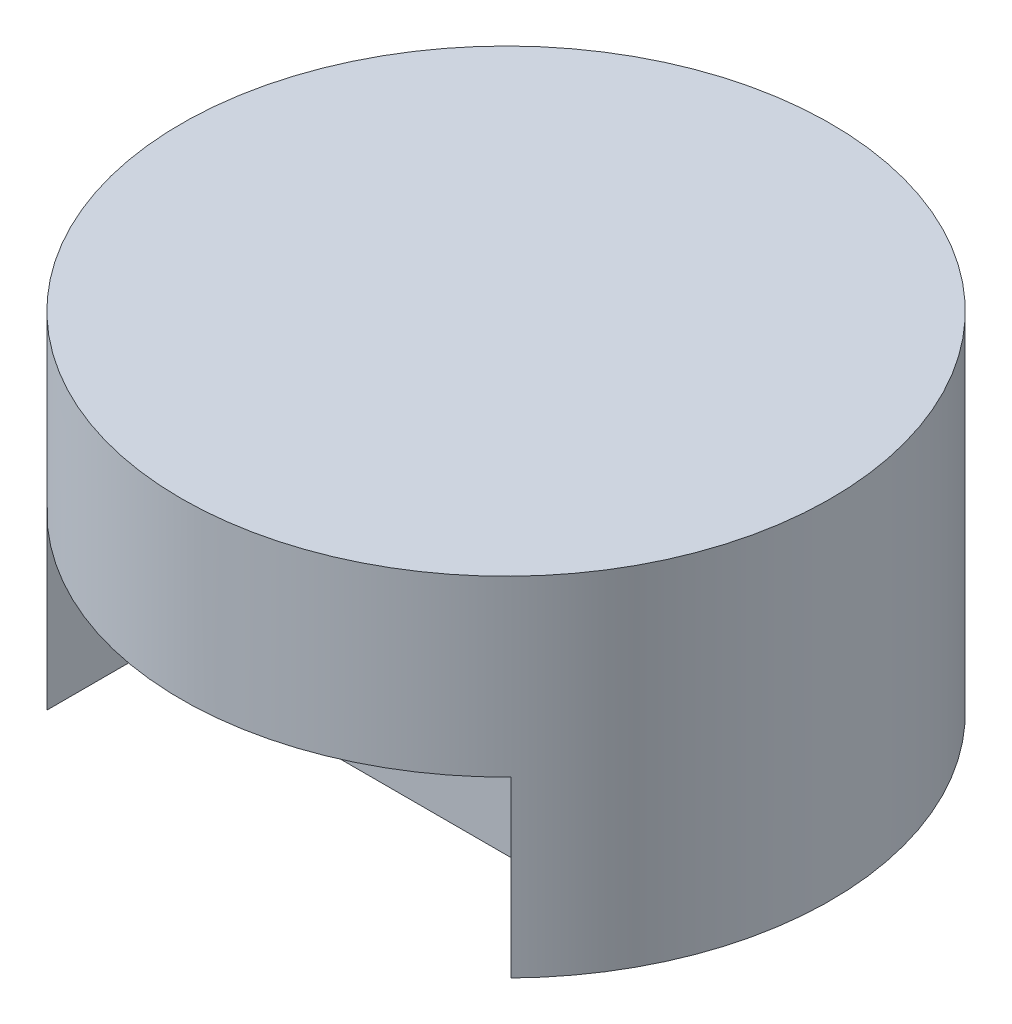
ISO-10303-21;
HEADER;
FILE_DESCRIPTION(('STEP AP214'),'2;1');
FILE_NAME('part.step','',(''),(''),'','','');
FILE_SCHEMA(('AUTOMOTIVE_DESIGN { 1 0 10303 214 1 1 1 1 }'));
ENDSEC;
DATA;
#1=APPLICATION_CONTEXT('core data for automotive mechanical design processes');
#2=APPLICATION_PROTOCOL_DEFINITION('international standard','automotive_design',2000,#1);
#3=PRODUCT_CONTEXT('',#1,'mechanical');
#4=PRODUCT('Part','Part','',(#3));
#5=PRODUCT_RELATED_PRODUCT_CATEGORY('part','',(#4));
#6=PRODUCT_DEFINITION_FORMATION('','',#4);
#7=PRODUCT_DEFINITION_CONTEXT('part definition',#1,'design');
#8=PRODUCT_DEFINITION('design','',#6,#7);
#9=PRODUCT_DEFINITION_SHAPE('','',#8);
#10=(LENGTH_UNIT() NAMED_UNIT(*) SI_UNIT(.MILLI.,.METRE.));
#11=(NAMED_UNIT(*) PLANE_ANGLE_UNIT() SI_UNIT($,.RADIAN.));
#12=(NAMED_UNIT(*) SI_UNIT($,.STERADIAN.) SOLID_ANGLE_UNIT());
#13=UNCERTAINTY_MEASURE_WITH_UNIT(LENGTH_MEASURE(1.E-05),#10,'distance_accuracy_value','');
#14=(GEOMETRIC_REPRESENTATION_CONTEXT(3) GLOBAL_UNCERTAINTY_ASSIGNED_CONTEXT((#13)) GLOBAL_UNIT_ASSIGNED_CONTEXT((#10,
#11,#12)) REPRESENTATION_CONTEXT('',''));
#15=CARTESIAN_POINT('',(0.,0.,0.));
#16=DIRECTION('',(0.,0.,1.));
#17=DIRECTION('',(1.,0.,0.));
#18=AXIS2_PLACEMENT_3D('',#15,#16,#17);
#19=CARTESIAN_POINT('',(0.,150.,0.));
#20=DIRECTION('',(0.,-1.,0.));
#21=DIRECTION('',(0.,0.,-1.));
#22=AXIS2_PLACEMENT_3D('',#19,#20,#21);
#23=CYLINDRICAL_SURFACE('',#22,140.);
#24=CARTESIAN_POINT('',(0.,150.,0.));
#25=DIRECTION('',(0.,1.,0.));
#26=DIRECTION('',(0.,0.,1.));
#27=AXIS2_PLACEMENT_3D('',#24,#25,#26);
#28=CIRCLE('',#27,140.);
#29=CARTESIAN_POINT('',(0.,150.,140.));
#30=VERTEX_POINT('',#29);
#31=EDGE_CURVE('E11',#30,#30,#28,.T.);
#32=ORIENTED_EDGE('',*,*,#31,.F.);
#33=EDGE_LOOP('',(#32));
#34=FACE_BOUND('',#33,.T.);
#35=CARTESIAN_POINT('',(0.,75.,0.));
#36=DIRECTION('',(0.,-1.,0.));
#37=DIRECTION('',(0.,0.,1.));
#38=AXIS2_PLACEMENT_3D('',#35,#36,#37);
#39=CIRCLE('',#38,140.);
#40=CARTESIAN_POINT('',(100.,75.,97.9795897113272));
#41=VERTEX_POINT('',#40);
#42=CARTESIAN_POINT('',(-100.,75.,97.9795897113272));
#43=VERTEX_POINT('',#42);
#44=EDGE_CURVE('E94',#41,#43,#39,.T.);
#45=ORIENTED_EDGE('',*,*,#44,.F.);
#46=DIRECTION('',(0.,-1.,0.));
#47=VECTOR('',#46,1.);
#48=CARTESIAN_POINT('',(100.,75.,97.9795897113272));
#49=LINE('',#48,#47);
#50=CARTESIAN_POINT('',(100.,0.,97.9795897113272));
#51=VERTEX_POINT('',#50);
#52=EDGE_CURVE('E56',#41,#51,#49,.T.);
#53=ORIENTED_EDGE('',*,*,#52,.T.);
#54=CARTESIAN_POINT('',(0.,0.,0.));
#55=DIRECTION('',(0.,1.,0.));
#56=DIRECTION('',(0.,0.,1.));
#57=AXIS2_PLACEMENT_3D('',#54,#55,#56);
#58=CIRCLE('',#57,140.);
#59=CARTESIAN_POINT('',(-100.,0.,97.9795897113272));
#60=VERTEX_POINT('',#59);
#61=EDGE_CURVE('E36',#51,#60,#58,.T.);
#62=ORIENTED_EDGE('',*,*,#61,.T.);
#63=DIRECTION('',(0.,-1.,0.));
#64=VECTOR('',#63,1.);
#65=CARTESIAN_POINT('',(-100.,75.,97.9795897113272));
#66=LINE('',#65,#64);
#67=EDGE_CURVE('E47',#43,#60,#66,.T.);
#68=ORIENTED_EDGE('',*,*,#67,.F.);
#69=EDGE_LOOP('',(#45,#53,#62,#68));
#70=FACE_BOUND('',#69,.T.);
#71=ADVANCED_FACE('F33',(#34,#70),#23,.T.);
#72=CARTESIAN_POINT('',(0.,150.,0.));
#73=DIRECTION('',(0.,1.,0.));
#74=DIRECTION('',(0.,0.,1.));
#75=AXIS2_PLACEMENT_3D('',#72,#73,#74);
#76=PLANE('',#75);
#77=ORIENTED_EDGE('',*,*,#31,.T.);
#78=EDGE_LOOP('',(#77));
#79=FACE_BOUND('',#78,.T.);
#80=ADVANCED_FACE('F112',(#79),#76,.T.);
#81=CARTESIAN_POINT('',(0.,0.,0.));
#82=DIRECTION('',(0.,1.,0.));
#83=DIRECTION('',(0.,0.,1.));
#84=AXIS2_PLACEMENT_3D('',#81,#82,#83);
#85=PLANE('',#84);
#86=ORIENTED_EDGE('',*,*,#61,.F.);
#87=DIRECTION('',(0.,0.,1.));
#88=VECTOR('',#87,1.);
#89=CARTESIAN_POINT('',(100.,0.,97.9795897113272));
#90=LINE('',#89,#88);
#91=CARTESIAN_POINT('',(100.,0.,52.9795897113272));
#92=VERTEX_POINT('',#91);
#93=EDGE_CURVE('E71',#92,#51,#90,.T.);
#94=ORIENTED_EDGE('',*,*,#93,.F.);
#95=DIRECTION('',(1.,0.,0.));
#96=VECTOR('',#95,1.);
#97=CARTESIAN_POINT('',(-100.,0.,52.9795897113272));
#98=LINE('',#97,#96);
#99=CARTESIAN_POINT('',(-100.,0.,52.9795897113272));
#100=VERTEX_POINT('',#99);
#101=EDGE_CURVE('E100',#100,#92,#98,.T.);
#102=ORIENTED_EDGE('',*,*,#101,.F.);
#103=DIRECTION('',(0.,0.,-1.));
#104=VECTOR('',#103,1.);
#105=CARTESIAN_POINT('',(-100.,0.,97.9795897113272));
#106=LINE('',#105,#104);
#107=EDGE_CURVE('E80',#60,#100,#106,.T.);
#108=ORIENTED_EDGE('',*,*,#107,.F.);
#109=EDGE_LOOP('',(#86,#94,#102,#108));
#110=FACE_BOUND('',#109,.T.);
#111=ADVANCED_FACE('F108',(#110),#85,.F.);
#112=CARTESIAN_POINT('',(100.,75.,97.9795897113272));
#113=DIRECTION('',(1.,0.,0.));
#114=DIRECTION('',(0.,0.,-1.));
#115=AXIS2_PLACEMENT_3D('',#112,#113,#114);
#116=PLANE('',#115);
#117=ORIENTED_EDGE('',*,*,#93,.T.);
#118=ORIENTED_EDGE('',*,*,#52,.F.);
#119=DIRECTION('',(0.,0.,1.));
#120=VECTOR('',#119,1.);
#121=CARTESIAN_POINT('',(100.,75.,97.9795897113272));
#122=LINE('',#121,#120);
#123=CARTESIAN_POINT('',(100.,75.,52.9795897113272));
#124=VERTEX_POINT('',#123);
#125=EDGE_CURVE('E90',#124,#41,#122,.T.);
#126=ORIENTED_EDGE('',*,*,#125,.F.);
#127=DIRECTION('',(0.,-1.,0.));
#128=VECTOR('',#127,1.);
#129=CARTESIAN_POINT('',(100.,75.,52.9795897113272));
#130=LINE('',#129,#128);
#131=EDGE_CURVE('E84',#124,#92,#130,.T.);
#132=ORIENTED_EDGE('',*,*,#131,.T.);
#133=EDGE_LOOP('',(#117,#118,#126,#132));
#134=FACE_BOUND('',#133,.T.);
#135=ADVANCED_FACE('F105',(#134),#116,.F.);
#136=CARTESIAN_POINT('',(-100.,75.,52.9795897113272));
#137=DIRECTION('',(0.,0.,-1.));
#138=DIRECTION('',(-1.,0.,0.));
#139=AXIS2_PLACEMENT_3D('',#136,#137,#138);
#140=PLANE('',#139);
#141=ORIENTED_EDGE('',*,*,#101,.T.);
#142=ORIENTED_EDGE('',*,*,#131,.F.);
#143=DIRECTION('',(1.,0.,0.));
#144=VECTOR('',#143,1.);
#145=CARTESIAN_POINT('',(-100.,75.,52.9795897113272));
#146=LINE('',#145,#144);
#147=CARTESIAN_POINT('',(-100.,75.,52.9795897113272));
#148=VERTEX_POINT('',#147);
#149=EDGE_CURVE('E87',#148,#124,#146,.T.);
#150=ORIENTED_EDGE('',*,*,#149,.F.);
#151=DIRECTION('',(0.,-1.,0.));
#152=VECTOR('',#151,1.);
#153=CARTESIAN_POINT('',(-100.,75.,52.9795897113272));
#154=LINE('',#153,#152);
#155=EDGE_CURVE('E77',#148,#100,#154,.T.);
#156=ORIENTED_EDGE('',*,*,#155,.T.);
#157=EDGE_LOOP('',(#141,#142,#150,#156));
#158=FACE_BOUND('',#157,.T.);
#159=ADVANCED_FACE('F88',(#158),#140,.F.);
#160=CARTESIAN_POINT('',(-100.,75.,97.9795897113272));
#161=DIRECTION('',(-1.,0.,0.));
#162=DIRECTION('',(0.,0.,1.));
#163=AXIS2_PLACEMENT_3D('',#160,#161,#162);
#164=PLANE('',#163);
#165=ORIENTED_EDGE('',*,*,#107,.T.);
#166=ORIENTED_EDGE('',*,*,#155,.F.);
#167=DIRECTION('',(0.,0.,-1.));
#168=VECTOR('',#167,1.);
#169=CARTESIAN_POINT('',(-100.,75.,97.9795897113272));
#170=LINE('',#169,#168);
#171=EDGE_CURVE('E75',#43,#148,#170,.T.);
#172=ORIENTED_EDGE('',*,*,#171,.F.);
#173=ORIENTED_EDGE('',*,*,#67,.T.);
#174=EDGE_LOOP('',(#165,#166,#172,#173));
#175=FACE_BOUND('',#174,.T.);
#176=ADVANCED_FACE('F79',(#175),#164,.F.);
#177=CARTESIAN_POINT('',(0.,75.,0.));
#178=DIRECTION('',(0.,1.,0.));
#179=DIRECTION('',(0.,0.,1.));
#180=AXIS2_PLACEMENT_3D('',#177,#178,#179);
#181=PLANE('',#180);
#182=ORIENTED_EDGE('',*,*,#44,.T.);
#183=ORIENTED_EDGE('',*,*,#171,.T.);
#184=ORIENTED_EDGE('',*,*,#149,.T.);
#185=ORIENTED_EDGE('',*,*,#125,.T.);
#186=EDGE_LOOP('',(#182,#183,#184,#185));
#187=FACE_BOUND('',#186,.T.);
#188=ADVANCED_FACE('F92',(#187),#181,.F.);
#189=CLOSED_SHELL('',(#71,#80,#111,#135,#159,#176,#188));
#190=MANIFOLD_SOLID_BREP('B2',#189);
#191=ADVANCED_BREP_SHAPE_REPRESENTATION('',(#18,#190),#14);
#192=SHAPE_DEFINITION_REPRESENTATION(#9,#191);
ENDSEC;
END-ISO-10303-21;
